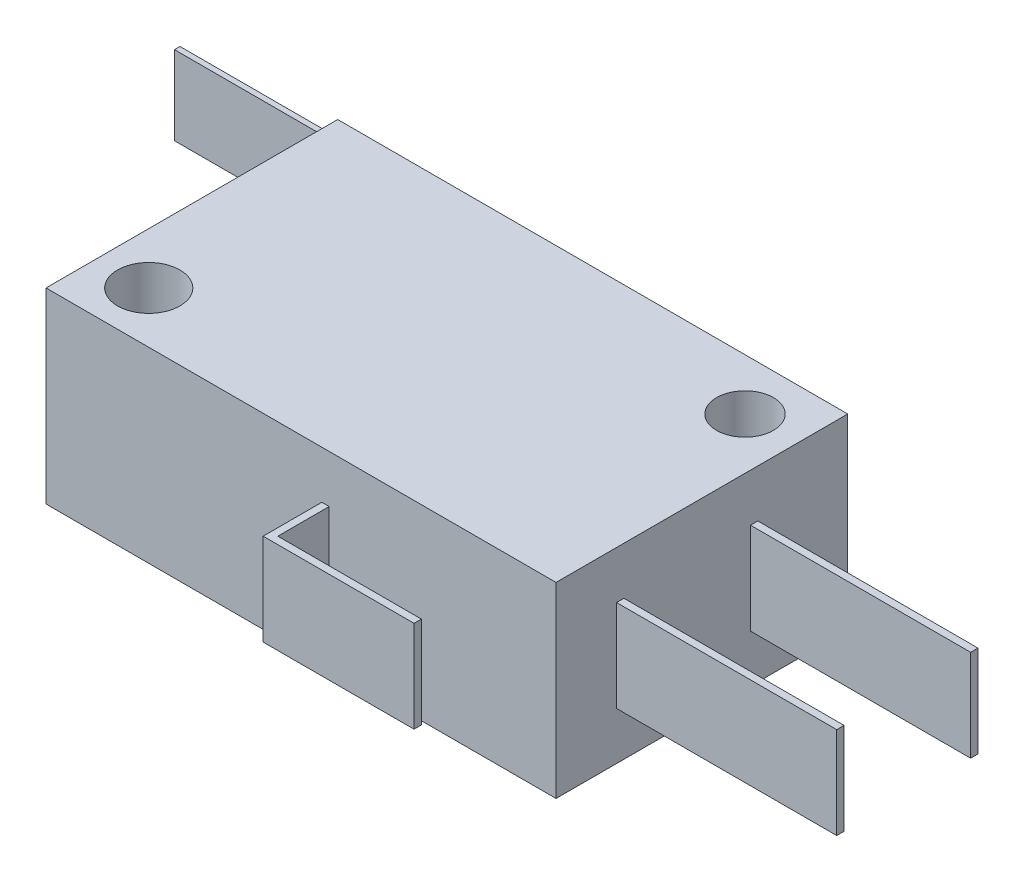
ISO-10303-21;
HEADER;
FILE_DESCRIPTION(('STEP AP214'),'2;1');
FILE_NAME('part.step','',(''),(''),'','','');
FILE_SCHEMA(('AUTOMOTIVE_DESIGN { 1 0 10303 214 1 1 1 1 }'));
ENDSEC;
DATA;
#1=APPLICATION_CONTEXT('core data for automotive mechanical design processes');
#2=APPLICATION_PROTOCOL_DEFINITION('international standard','automotive_design',2000,#1);
#3=PRODUCT_CONTEXT('',#1,'mechanical');
#4=PRODUCT('Part','Part','',(#3));
#5=PRODUCT_RELATED_PRODUCT_CATEGORY('part','',(#4));
#6=PRODUCT_DEFINITION_FORMATION('','',#4);
#7=PRODUCT_DEFINITION_CONTEXT('part definition',#1,'design');
#8=PRODUCT_DEFINITION('design','',#6,#7);
#9=PRODUCT_DEFINITION_SHAPE('','',#8);
#10=(LENGTH_UNIT() NAMED_UNIT(*) SI_UNIT(.MILLI.,.METRE.));
#11=(NAMED_UNIT(*) PLANE_ANGLE_UNIT() SI_UNIT($,.RADIAN.));
#12=(NAMED_UNIT(*) SI_UNIT($,.STERADIAN.) SOLID_ANGLE_UNIT());
#13=UNCERTAINTY_MEASURE_WITH_UNIT(LENGTH_MEASURE(1.E-05),#10,'distance_accuracy_value','');
#14=(GEOMETRIC_REPRESENTATION_CONTEXT(3) GLOBAL_UNCERTAINTY_ASSIGNED_CONTEXT((#13)) GLOBAL_UNIT_ASSIGNED_CONTEXT((#10,
#11,#12)) REPRESENTATION_CONTEXT('',''));
#15=CARTESIAN_POINT('',(0.,0.,0.));
#16=DIRECTION('',(0.,0.,1.));
#17=DIRECTION('',(1.,0.,0.));
#18=AXIS2_PLACEMENT_3D('',#15,#16,#17);
#19=CARTESIAN_POINT('',(-8.89920067803975,2.15,-7.95));
#20=DIRECTION('',(0.,-1.,0.));
#21=DIRECTION('',(0.,0.,-1.));
#22=AXIS2_PLACEMENT_3D('',#19,#20,#21);
#23=CYLINDRICAL_SURFACE('',#22,1.8);
#24=CARTESIAN_POINT('',(-8.89920067803975,2.15,-7.95));
#25=DIRECTION('',(0.,1.,0.));
#26=DIRECTION('',(0.,0.,1.));
#27=AXIS2_PLACEMENT_3D('',#24,#25,#26);
#28=CIRCLE('',#27,1.8);
#29=CARTESIAN_POINT('',(-8.89920067803975,2.15,-6.15));
#30=VERTEX_POINT('',#29);
#31=EDGE_CURVE('E11',#30,#30,#28,.T.);
#32=ORIENTED_EDGE('',*,*,#31,.F.);
#33=EDGE_LOOP('',(#32));
#34=FACE_BOUND('',#33,.T.);
#35=CARTESIAN_POINT('',(-8.89920067803975,-2.15,-7.95));
#36=DIRECTION('',(0.,1.,0.));
#37=DIRECTION('',(0.,0.,1.));
#38=AXIS2_PLACEMENT_3D('',#35,#36,#37);
#39=CIRCLE('',#38,1.8);
#40=CARTESIAN_POINT('',(-8.89920067803975,-2.15,-6.15));
#41=VERTEX_POINT('',#40);
#42=EDGE_CURVE('E45',#41,#41,#39,.T.);
#43=ORIENTED_EDGE('',*,*,#42,.T.);
#44=EDGE_LOOP('',(#43));
#45=FACE_BOUND('',#44,.T.);
#46=ADVANCED_FACE('F42',(#34,#45),#23,.T.);
#47=CARTESIAN_POINT('',(-8.89920067803975,2.15,-7.95));
#48=DIRECTION('',(0.,1.,0.));
#49=DIRECTION('',(0.,0.,1.));
#50=AXIS2_PLACEMENT_3D('',#47,#48,#49);
#51=PLANE('',#50);
#52=ORIENTED_EDGE('',*,*,#31,.T.);
#53=EDGE_LOOP('',(#52));
#54=FACE_BOUND('',#53,.T.);
#55=ADVANCED_FACE('F57',(#54),#51,.T.);
#56=CARTESIAN_POINT('',(-8.89920067803975,-2.15,-7.95));
#57=DIRECTION('',(0.,1.,0.));
#58=DIRECTION('',(0.,0.,1.));
#59=AXIS2_PLACEMENT_3D('',#56,#57,#58);
#60=PLANE('',#59);
#61=ORIENTED_EDGE('',*,*,#42,.F.);
#62=EDGE_LOOP('',(#61));
#63=FACE_BOUND('',#62,.T.);
#64=ADVANCED_FACE('F55',(#63),#60,.F.);
#65=CLOSED_SHELL('',(#46,#55,#64));
#66=MANIFOLD_SOLID_BREP('B2',#65);
#67=CARTESIAN_POINT('',(-13.9,5.1,7.95));
#68=DIRECTION('',(0.,0.,-1.));
#69=DIRECTION('',(-1.,0.,0.));
#70=AXIS2_PLACEMENT_3D('',#67,#68,#69);
#71=PLANE('',#70);
#72=DIRECTION('',(1.,0.,0.));
#73=VECTOR('',#72,1.);
#74=CARTESIAN_POINT('',(-13.9,-5.1,7.95));
#75=LINE('',#74,#73);
#76=CARTESIAN_POINT('',(-13.9,-5.1,7.95));
#77=VERTEX_POINT('',#76);
#78=CARTESIAN_POINT('',(13.9,-5.1,7.95));
#79=VERTEX_POINT('',#78);
#80=EDGE_CURVE('E386',#77,#79,#75,.T.);
#81=ORIENTED_EDGE('',*,*,#80,.T.);
#82=DIRECTION('',(0.,-1.,0.));
#83=VECTOR('',#82,1.);
#84=CARTESIAN_POINT('',(13.9,5.1,7.95));
#85=LINE('',#84,#83);
#86=CARTESIAN_POINT('',(13.9,5.1,7.95));
#87=VERTEX_POINT('',#86);
#88=EDGE_CURVE('E392',#87,#79,#85,.T.);
#89=ORIENTED_EDGE('',*,*,#88,.F.);
#90=DIRECTION('',(1.,0.,0.));
#91=VECTOR('',#90,1.);
#92=CARTESIAN_POINT('',(-13.9,5.1,7.95));
#93=LINE('',#92,#91);
#94=CARTESIAN_POINT('',(-13.9,5.1,7.95));
#95=VERTEX_POINT('',#94);
#96=EDGE_CURVE('E390',#95,#87,#93,.T.);
#97=ORIENTED_EDGE('',*,*,#96,.F.);
#98=DIRECTION('',(0.,-1.,0.));
#99=VECTOR('',#98,1.);
#100=CARTESIAN_POINT('',(-13.9,5.1,7.95));
#101=LINE('',#100,#99);
#102=EDGE_CURVE('E402',#95,#77,#101,.T.);
#103=ORIENTED_EDGE('',*,*,#102,.T.);
#104=EDGE_LOOP('',(#81,#89,#97,#103));
#105=FACE_BOUND('',#104,.T.);
#106=DIRECTION('',(-1.,0.,0.));
#107=VECTOR('',#106,1.);
#108=CARTESIAN_POINT('',(1.135522271517,2.5,7.95));
#109=LINE('',#108,#107);
#110=CARTESIAN_POINT('',(1.535522271517,2.5,7.95));
#111=VERTEX_POINT('',#110);
#112=CARTESIAN_POINT('',(1.135522271517,2.5,7.95));
#113=VERTEX_POINT('',#112);
#114=EDGE_CURVE('E249',#111,#113,#109,.T.);
#115=ORIENTED_EDGE('',*,*,#114,.F.);
#116=DIRECTION('',(0.,-1.,0.));
#117=VECTOR('',#116,1.);
#118=CARTESIAN_POINT('',(1.535522271517,2.5,7.95));
#119=LINE('',#118,#117);
#120=CARTESIAN_POINT('',(1.535522271517,-2.5,7.95));
#121=VERTEX_POINT('',#120);
#122=EDGE_CURVE('E746',#111,#121,#119,.T.);
#123=ORIENTED_EDGE('',*,*,#122,.T.);
#124=DIRECTION('',(-1.,0.,0.));
#125=VECTOR('',#124,1.);
#126=CARTESIAN_POINT('',(1.135522271517,-2.5,7.95));
#127=LINE('',#126,#125);
#128=CARTESIAN_POINT('',(1.135522271517,-2.5,7.95));
#129=VERTEX_POINT('',#128);
#130=EDGE_CURVE('E262',#121,#129,#127,.T.);
#131=ORIENTED_EDGE('',*,*,#130,.T.);
#132=DIRECTION('',(0.,-1.,0.));
#133=VECTOR('',#132,1.);
#134=CARTESIAN_POINT('',(1.135522271517,2.5,7.95));
#135=LINE('',#134,#133);
#136=EDGE_CURVE('E97',#113,#129,#135,.T.);
#137=ORIENTED_EDGE('',*,*,#136,.F.);
#138=EDGE_LOOP('',(#115,#123,#131,#137));
#139=FACE_BOUND('',#138,.T.);
#140=ADVANCED_FACE('F82',(#105,#139),#71,.F.);
#141=CARTESIAN_POINT('',(13.9,5.1,7.95));
#142=DIRECTION('',(-1.,0.,0.));
#143=DIRECTION('',(0.,0.,1.));
#144=AXIS2_PLACEMENT_3D('',#141,#142,#143);
#145=PLANE('',#144);
#146=DIRECTION('',(0.,0.,1.));
#147=VECTOR('',#146,1.);
#148=CARTESIAN_POINT('',(13.9,2.5,-2.65));
#149=LINE('',#148,#147);
#150=CARTESIAN_POINT('',(13.9,2.5,-3.05));
#151=VERTEX_POINT('',#150);
#152=CARTESIAN_POINT('',(13.9,2.5,-2.65));
#153=VERTEX_POINT('',#152);
#154=EDGE_CURVE('E297',#151,#153,#149,.T.);
#155=ORIENTED_EDGE('',*,*,#154,.F.);
#156=DIRECTION('',(0.,-1.,0.));
#157=VECTOR('',#156,1.);
#158=CARTESIAN_POINT('',(13.9,2.5,-3.05));
#159=LINE('',#158,#157);
#160=CARTESIAN_POINT('',(13.9,-2.5,-3.05));
#161=VERTEX_POINT('',#160);
#162=EDGE_CURVE('E307',#151,#161,#159,.T.);
#163=ORIENTED_EDGE('',*,*,#162,.T.);
#164=DIRECTION('',(0.,0.,1.));
#165=VECTOR('',#164,1.);
#166=CARTESIAN_POINT('',(13.9,-2.5,-2.65));
#167=LINE('',#166,#165);
#168=CARTESIAN_POINT('',(13.9,-2.5,-2.65));
#169=VERTEX_POINT('',#168);
#170=EDGE_CURVE('E296',#161,#169,#167,.T.);
#171=ORIENTED_EDGE('',*,*,#170,.T.);
#172=DIRECTION('',(0.,-1.,0.));
#173=VECTOR('',#172,1.);
#174=CARTESIAN_POINT('',(13.9,2.5,-2.65));
#175=LINE('',#174,#173);
#176=EDGE_CURVE('E323',#153,#169,#175,.T.);
#177=ORIENTED_EDGE('',*,*,#176,.F.);
#178=EDGE_LOOP('',(#155,#163,#171,#177));
#179=FACE_BOUND('',#178,.T.);
#180=DIRECTION('',(0.,0.,-1.));
#181=VECTOR('',#180,1.);
#182=CARTESIAN_POINT('',(13.9,-5.1,7.95));
#183=LINE('',#182,#181);
#184=CARTESIAN_POINT('',(13.9,-5.1,-7.95));
#185=VERTEX_POINT('',#184);
#186=EDGE_CURVE('E377',#79,#185,#183,.T.);
#187=ORIENTED_EDGE('',*,*,#186,.T.);
#188=DIRECTION('',(0.,-1.,0.));
#189=VECTOR('',#188,1.);
#190=CARTESIAN_POINT('',(13.9,5.1,-7.95));
#191=LINE('',#190,#189);
#192=CARTESIAN_POINT('',(13.9,5.1,-7.95));
#193=VERTEX_POINT('',#192);
#194=EDGE_CURVE('E40',#193,#185,#191,.T.);
#195=ORIENTED_EDGE('',*,*,#194,.F.);
#196=DIRECTION('',(0.,0.,-1.));
#197=VECTOR('',#196,1.);
#198=CARTESIAN_POINT('',(13.9,5.1,7.95));
#199=LINE('',#198,#197);
#200=EDGE_CURVE('E382',#87,#193,#199,.T.);
#201=ORIENTED_EDGE('',*,*,#200,.F.);
#202=ORIENTED_EDGE('',*,*,#88,.T.);
#203=EDGE_LOOP('',(#187,#195,#201,#202));
#204=FACE_BOUND('',#203,.T.);
#205=DIRECTION('',(0.,0.,1.));
#206=VECTOR('',#205,1.);
#207=CARTESIAN_POINT('',(13.9,2.5,4.65));
#208=LINE('',#207,#206);
#209=CARTESIAN_POINT('',(13.9,2.5,4.25));
#210=VERTEX_POINT('',#209);
#211=CARTESIAN_POINT('',(13.9,2.5,4.65));
#212=VERTEX_POINT('',#211);
#213=EDGE_CURVE('E272',#210,#212,#208,.T.);
#214=ORIENTED_EDGE('',*,*,#213,.F.);
#215=DIRECTION('',(0.,-1.,0.));
#216=VECTOR('',#215,1.);
#217=CARTESIAN_POINT('',(13.9,2.5,4.25));
#218=LINE('',#217,#216);
#219=CARTESIAN_POINT('',(13.9,-2.5,4.25));
#220=VERTEX_POINT('',#219);
#221=EDGE_CURVE('E281',#210,#220,#218,.T.);
#222=ORIENTED_EDGE('',*,*,#221,.T.);
#223=DIRECTION('',(0.,0.,1.));
#224=VECTOR('',#223,1.);
#225=CARTESIAN_POINT('',(13.9,-2.5,4.65));
#226=LINE('',#225,#224);
#227=CARTESIAN_POINT('',(13.9,-2.5,4.65));
#228=VERTEX_POINT('',#227);
#229=EDGE_CURVE('E263',#220,#228,#226,.T.);
#230=ORIENTED_EDGE('',*,*,#229,.T.);
#231=DIRECTION('',(0.,-1.,0.));
#232=VECTOR('',#231,1.);
#233=CARTESIAN_POINT('',(13.9,2.5,4.65));
#234=LINE('',#233,#232);
#235=EDGE_CURVE('E105',#212,#228,#234,.T.);
#236=ORIENTED_EDGE('',*,*,#235,.F.);
#237=EDGE_LOOP('',(#214,#222,#230,#236));
#238=FACE_BOUND('',#237,.T.);
#239=ADVANCED_FACE('F84',(#179,#204,#238),#145,.F.);
#240=CARTESIAN_POINT('',(-13.9,5.1,-7.95));
#241=DIRECTION('',(0.,0.,1.));
#242=DIRECTION('',(1.,0.,0.));
#243=AXIS2_PLACEMENT_3D('',#240,#241,#242);
#244=PLANE('',#243);
#245=DIRECTION('',(0.,-1.,0.));
#246=VECTOR('',#245,1.);
#247=CARTESIAN_POINT('',(2.9,2.15,-7.95));
#248=LINE('',#247,#246);
#249=CARTESIAN_POINT('',(2.9,2.15,-7.95));
#250=VERTEX_POINT('',#249);
#251=CARTESIAN_POINT('',(2.9,-2.15,-7.95));
#252=VERTEX_POINT('',#251);
#253=EDGE_CURVE('E366',#250,#252,#248,.T.);
#254=ORIENTED_EDGE('',*,*,#253,.F.);
#255=DIRECTION('',(1.,0.,0.));
#256=VECTOR('',#255,1.);
#257=CARTESIAN_POINT('',(2.6,2.15,-7.95));
#258=LINE('',#257,#256);
#259=CARTESIAN_POINT('',(2.6,2.15,-7.95));
#260=VERTEX_POINT('',#259);
#261=EDGE_CURVE('E326',#260,#250,#258,.T.);
#262=ORIENTED_EDGE('',*,*,#261,.F.);
#263=DIRECTION('',(0.,-1.,0.));
#264=VECTOR('',#263,1.);
#265=CARTESIAN_POINT('',(2.6,2.15,-7.95));
#266=LINE('',#265,#264);
#267=CARTESIAN_POINT('',(2.6,-2.15,-7.95));
#268=VERTEX_POINT('',#267);
#269=EDGE_CURVE('E341',#260,#268,#266,.T.);
#270=ORIENTED_EDGE('',*,*,#269,.T.);
#271=DIRECTION('',(1.,0.,0.));
#272=VECTOR('',#271,1.);
#273=CARTESIAN_POINT('',(2.6,-2.15,-7.95));
#274=LINE('',#273,#272);
#275=EDGE_CURVE('E325',#268,#252,#274,.T.);
#276=ORIENTED_EDGE('',*,*,#275,.T.);
#277=EDGE_LOOP('',(#254,#262,#270,#276));
#278=FACE_BOUND('',#277,.T.);
#279=DIRECTION('',(-1.,0.,0.));
#280=VECTOR('',#279,1.);
#281=CARTESIAN_POINT('',(-13.9,-5.1,-7.95));
#282=LINE('',#281,#280);
#283=CARTESIAN_POINT('',(-13.9,-5.1,-7.95));
#284=VERTEX_POINT('',#283);
#285=EDGE_CURVE('E395',#185,#284,#282,.T.);
#286=ORIENTED_EDGE('',*,*,#285,.T.);
#287=DIRECTION('',(0.,-1.,0.));
#288=VECTOR('',#287,1.);
#289=CARTESIAN_POINT('',(-13.9,5.1,-7.95));
#290=LINE('',#289,#288);
#291=CARTESIAN_POINT('',(-13.9,5.1,-7.95));
#292=VERTEX_POINT('',#291);
#293=EDGE_CURVE('E90',#292,#284,#290,.T.);
#294=ORIENTED_EDGE('',*,*,#293,.F.);
#295=DIRECTION('',(-1.,0.,0.));
#296=VECTOR('',#295,1.);
#297=CARTESIAN_POINT('',(-13.9,5.1,-7.95));
#298=LINE('',#297,#296);
#299=EDGE_CURVE('E385',#193,#292,#298,.T.);
#300=ORIENTED_EDGE('',*,*,#299,.F.);
#301=ORIENTED_EDGE('',*,*,#194,.T.);
#302=EDGE_LOOP('',(#286,#294,#300,#301));
#303=FACE_BOUND('',#302,.T.);
#304=ADVANCED_FACE('F425',(#278,#303),#244,.F.);
#305=CARTESIAN_POINT('',(-13.9,5.1,7.95));
#306=DIRECTION('',(1.,0.,0.));
#307=DIRECTION('',(0.,0.,-1.));
#308=AXIS2_PLACEMENT_3D('',#305,#306,#307);
#309=PLANE('',#308);
#310=DIRECTION('',(0.,0.,1.));
#311=VECTOR('',#310,1.);
#312=CARTESIAN_POINT('',(-13.9,-5.1,7.95));
#313=LINE('',#312,#311);
#314=EDGE_CURVE('E397',#284,#77,#313,.T.);
#315=ORIENTED_EDGE('',*,*,#314,.T.);
#316=ORIENTED_EDGE('',*,*,#102,.F.);
#317=DIRECTION('',(0.,0.,1.));
#318=VECTOR('',#317,1.);
#319=CARTESIAN_POINT('',(-13.9,5.1,7.95));
#320=LINE('',#319,#318);
#321=EDGE_CURVE('E388',#292,#95,#320,.T.);
#322=ORIENTED_EDGE('',*,*,#321,.F.);
#323=ORIENTED_EDGE('',*,*,#293,.T.);
#324=EDGE_LOOP('',(#315,#316,#322,#323));
#325=FACE_BOUND('',#324,.T.);
#326=ADVANCED_FACE('F409',(#325),#309,.F.);
#327=CARTESIAN_POINT('',(0.,5.1,0.));
#328=DIRECTION('',(0.,-1.,0.));
#329=DIRECTION('',(0.,0.,-1.));
#330=AXIS2_PLACEMENT_3D('',#327,#328,#329);
#331=PLANE('',#330);
#332=CARTESIAN_POINT('',(-11.1,5.1,5.15));
#333=DIRECTION('',(0.,1.,0.));
#334=DIRECTION('',(0.,0.,1.));
#335=AXIS2_PLACEMENT_3D('',#332,#333,#334);
#336=CIRCLE('',#335,1.7);
#337=CARTESIAN_POINT('',(-11.1,5.1,6.85));
#338=VERTEX_POINT('',#337);
#339=EDGE_CURVE('E370',#338,#338,#336,.T.);
#340=ORIENTED_EDGE('',*,*,#339,.F.);
#341=EDGE_LOOP('',(#340));
#342=FACE_BOUND('',#341,.T.);
#343=CARTESIAN_POINT('',(11.1,5.1,-5.15));
#344=DIRECTION('',(0.,1.,0.));
#345=DIRECTION('',(0.,0.,1.));
#346=AXIS2_PLACEMENT_3D('',#343,#344,#345);
#347=CIRCLE('',#346,1.55);
#348=CARTESIAN_POINT('',(11.1,5.1,-3.6));
#349=VERTEX_POINT('',#348);
#350=EDGE_CURVE('E374',#349,#349,#347,.T.);
#351=ORIENTED_EDGE('',*,*,#350,.F.);
#352=EDGE_LOOP('',(#351));
#353=FACE_BOUND('',#352,.T.);
#354=ORIENTED_EDGE('',*,*,#200,.T.);
#355=ORIENTED_EDGE('',*,*,#299,.T.);
#356=ORIENTED_EDGE('',*,*,#321,.T.);
#357=ORIENTED_EDGE('',*,*,#96,.T.);
#358=EDGE_LOOP('',(#354,#355,#356,#357));
#359=FACE_BOUND('',#358,.T.);
#360=ADVANCED_FACE('F424',(#342,#353,#359),#331,.F.);
#361=CARTESIAN_POINT('',(0.,-5.1,0.));
#362=DIRECTION('',(0.,-1.,0.));
#363=DIRECTION('',(0.,0.,-1.));
#364=AXIS2_PLACEMENT_3D('',#361,#362,#363);
#365=PLANE('',#364);
#366=CARTESIAN_POINT('',(-11.1,-5.1,5.15));
#367=DIRECTION('',(0.,1.,0.));
#368=DIRECTION('',(0.,0.,1.));
#369=AXIS2_PLACEMENT_3D('',#366,#367,#368);
#370=CIRCLE('',#369,1.7);
#371=CARTESIAN_POINT('',(-11.1,-5.1,6.85));
#372=VERTEX_POINT('',#371);
#373=EDGE_CURVE('E373',#372,#372,#370,.T.);
#374=ORIENTED_EDGE('',*,*,#373,.T.);
#375=EDGE_LOOP('',(#374));
#376=FACE_BOUND('',#375,.T.);
#377=CARTESIAN_POINT('',(11.1,-5.1,-5.15));
#378=DIRECTION('',(0.,1.,0.));
#379=DIRECTION('',(0.,0.,1.));
#380=AXIS2_PLACEMENT_3D('',#377,#378,#379);
#381=CIRCLE('',#380,1.55);
#382=CARTESIAN_POINT('',(11.1,-5.1,-3.6));
#383=VERTEX_POINT('',#382);
#384=EDGE_CURVE('E369',#383,#383,#381,.T.);
#385=ORIENTED_EDGE('',*,*,#384,.T.);
#386=EDGE_LOOP('',(#385));
#387=FACE_BOUND('',#386,.T.);
#388=ORIENTED_EDGE('',*,*,#186,.F.);
#389=ORIENTED_EDGE('',*,*,#80,.F.);
#390=ORIENTED_EDGE('',*,*,#314,.F.);
#391=ORIENTED_EDGE('',*,*,#285,.F.);
#392=EDGE_LOOP('',(#388,#389,#390,#391));
#393=FACE_BOUND('',#392,.T.);
#394=ADVANCED_FACE('F415',(#376,#387,#393),#365,.T.);
#395=CARTESIAN_POINT('',(11.1,-5.1,-5.15));
#396=DIRECTION('',(0.,1.,0.));
#397=DIRECTION('',(0.,0.,1.));
#398=AXIS2_PLACEMENT_3D('',#395,#396,#397);
#399=CYLINDRICAL_SURFACE('',#398,1.55);
#400=ORIENTED_EDGE('',*,*,#384,.F.);
#401=EDGE_LOOP('',(#400));
#402=FACE_BOUND('',#401,.T.);
#403=ORIENTED_EDGE('',*,*,#350,.T.);
#404=EDGE_LOOP('',(#403));
#405=FACE_BOUND('',#404,.T.);
#406=ADVANCED_FACE('F441',(#402,#405),#399,.F.);
#407=CARTESIAN_POINT('',(-11.1,-5.1,5.15));
#408=DIRECTION('',(0.,1.,0.));
#409=DIRECTION('',(0.,0.,1.));
#410=AXIS2_PLACEMENT_3D('',#407,#408,#409);
#411=CYLINDRICAL_SURFACE('',#410,1.7);
#412=ORIENTED_EDGE('',*,*,#373,.F.);
#413=EDGE_LOOP('',(#412));
#414=FACE_BOUND('',#413,.T.);
#415=ORIENTED_EDGE('',*,*,#339,.T.);
#416=EDGE_LOOP('',(#415));
#417=FACE_BOUND('',#416,.T.);
#418=ADVANCED_FACE('F448',(#414,#417),#411,.F.);
#419=CARTESIAN_POINT('',(2.9,2.15,-7.95));
#420=DIRECTION('',(-1.,0.,0.));
#421=DIRECTION('',(0.,0.,1.));
#422=AXIS2_PLACEMENT_3D('',#419,#420,#421);
#423=PLANE('',#422);
#424=DIRECTION('',(0.,0.,-1.));
#425=VECTOR('',#424,1.);
#426=CARTESIAN_POINT('',(2.9,-2.15,-7.95));
#427=LINE('',#426,#425);
#428=CARTESIAN_POINT('',(2.9,-2.15,-10.05));
#429=VERTEX_POINT('',#428);
#430=EDGE_CURVE('E343',#252,#429,#427,.T.);
#431=ORIENTED_EDGE('',*,*,#430,.T.);
#432=DIRECTION('',(0.,-1.,0.));
#433=VECTOR('',#432,1.);
#434=CARTESIAN_POINT('',(2.9,2.15,-10.05));
#435=LINE('',#434,#433);
#436=CARTESIAN_POINT('',(2.9,2.15,-10.05));
#437=VERTEX_POINT('',#436);
#438=EDGE_CURVE('E363',#437,#429,#435,.T.);
#439=ORIENTED_EDGE('',*,*,#438,.F.);
#440=DIRECTION('',(0.,0.,-1.));
#441=VECTOR('',#440,1.);
#442=CARTESIAN_POINT('',(2.9,2.15,-7.95));
#443=LINE('',#442,#441);
#444=EDGE_CURVE('E329',#250,#437,#443,.T.);
#445=ORIENTED_EDGE('',*,*,#444,.F.);
#446=ORIENTED_EDGE('',*,*,#253,.T.);
#447=EDGE_LOOP('',(#431,#439,#445,#446));
#448=FACE_BOUND('',#447,.T.);
#449=ADVANCED_FACE('F452',(#448),#423,.F.);
#450=CARTESIAN_POINT('',(2.9,2.15,-10.05));
#451=DIRECTION('',(0.,0.,1.));
#452=DIRECTION('',(1.,0.,0.));
#453=AXIS2_PLACEMENT_3D('',#450,#451,#452);
#454=PLANE('',#453);
#455=DIRECTION('',(-1.,0.,0.));
#456=VECTOR('',#455,1.);
#457=CARTESIAN_POINT('',(2.9,-2.15,-10.05));
#458=LINE('',#457,#456);
#459=CARTESIAN_POINT('',(-24.6,-2.15,-10.05));
#460=VERTEX_POINT('',#459);
#461=EDGE_CURVE('E345',#429,#460,#458,.T.);
#462=ORIENTED_EDGE('',*,*,#461,.T.);
#463=DIRECTION('',(0.,-1.,0.));
#464=VECTOR('',#463,1.);
#465=CARTESIAN_POINT('',(-24.6,2.15,-10.05));
#466=LINE('',#465,#464);
#467=CARTESIAN_POINT('',(-24.6,2.15,-10.05));
#468=VERTEX_POINT('',#467);
#469=EDGE_CURVE('E360',#468,#460,#466,.T.);
#470=ORIENTED_EDGE('',*,*,#469,.F.);
#471=DIRECTION('',(-1.,0.,0.));
#472=VECTOR('',#471,1.);
#473=CARTESIAN_POINT('',(2.9,2.15,-10.05));
#474=LINE('',#473,#472);
#475=EDGE_CURVE('E332',#437,#468,#474,.T.);
#476=ORIENTED_EDGE('',*,*,#475,.F.);
#477=ORIENTED_EDGE('',*,*,#438,.T.);
#478=EDGE_LOOP('',(#462,#470,#476,#477));
#479=FACE_BOUND('',#478,.T.);
#480=ADVANCED_FACE('F456',(#479),#454,.F.);
#481=CARTESIAN_POINT('',(-24.6,2.15,-10.05));
#482=DIRECTION('',(1.,0.,0.));
#483=DIRECTION('',(0.,0.,-1.));
#484=AXIS2_PLACEMENT_3D('',#481,#482,#483);
#485=PLANE('',#484);
#486=DIRECTION('',(0.,0.,1.));
#487=VECTOR('',#486,1.);
#488=CARTESIAN_POINT('',(-24.6,-2.15,-10.05));
#489=LINE('',#488,#487);
#490=CARTESIAN_POINT('',(-24.6,-2.15,-9.75));
#491=VERTEX_POINT('',#490);
#492=EDGE_CURVE('E347',#460,#491,#489,.T.);
#493=ORIENTED_EDGE('',*,*,#492,.T.);
#494=DIRECTION('',(0.,-1.,0.));
#495=VECTOR('',#494,1.);
#496=CARTESIAN_POINT('',(-24.6,2.15,-9.75));
#497=LINE('',#496,#495);
#498=CARTESIAN_POINT('',(-24.6,2.15,-9.75));
#499=VERTEX_POINT('',#498);
#500=EDGE_CURVE('E357',#499,#491,#497,.T.);
#501=ORIENTED_EDGE('',*,*,#500,.F.);
#502=DIRECTION('',(0.,0.,1.));
#503=VECTOR('',#502,1.);
#504=CARTESIAN_POINT('',(-24.6,2.15,-10.05));
#505=LINE('',#504,#503);
#506=EDGE_CURVE('E334',#468,#499,#505,.T.);
#507=ORIENTED_EDGE('',*,*,#506,.F.);
#508=ORIENTED_EDGE('',*,*,#469,.T.);
#509=EDGE_LOOP('',(#493,#501,#507,#508));
#510=FACE_BOUND('',#509,.T.);
#511=ADVANCED_FACE('F460',(#510),#485,.F.);
#512=CARTESIAN_POINT('',(-24.6,2.15,-9.75));
#513=DIRECTION('',(0.,0.,-1.));
#514=DIRECTION('',(-1.,0.,0.));
#515=AXIS2_PLACEMENT_3D('',#512,#513,#514);
#516=PLANE('',#515);
#517=DIRECTION('',(1.,0.,0.));
#518=VECTOR('',#517,1.);
#519=CARTESIAN_POINT('',(-24.6,-2.15,-9.75));
#520=LINE('',#519,#518);
#521=CARTESIAN_POINT('',(2.6,-2.15,-9.75));
#522=VERTEX_POINT('',#521);
#523=EDGE_CURVE('E349',#491,#522,#520,.T.);
#524=ORIENTED_EDGE('',*,*,#523,.T.);
#525=DIRECTION('',(0.,-1.,0.));
#526=VECTOR('',#525,1.);
#527=CARTESIAN_POINT('',(2.6,2.15,-9.75));
#528=LINE('',#527,#526);
#529=CARTESIAN_POINT('',(2.6,2.15,-9.75));
#530=VERTEX_POINT('',#529);
#531=EDGE_CURVE('E354',#530,#522,#528,.T.);
#532=ORIENTED_EDGE('',*,*,#531,.F.);
#533=DIRECTION('',(1.,0.,0.));
#534=VECTOR('',#533,1.);
#535=CARTESIAN_POINT('',(-24.6,2.15,-9.75));
#536=LINE('',#535,#534);
#537=EDGE_CURVE('E336',#499,#530,#536,.T.);
#538=ORIENTED_EDGE('',*,*,#537,.F.);
#539=ORIENTED_EDGE('',*,*,#500,.T.);
#540=EDGE_LOOP('',(#524,#532,#538,#539));
#541=FACE_BOUND('',#540,.T.);
#542=ADVANCED_FACE('F464',(#541),#516,.F.);
#543=CARTESIAN_POINT('',(2.6,2.15,-9.75));
#544=DIRECTION('',(1.,0.,0.));
#545=DIRECTION('',(0.,0.,-1.));
#546=AXIS2_PLACEMENT_3D('',#543,#544,#545);
#547=PLANE('',#546);
#548=DIRECTION('',(0.,0.,1.));
#549=VECTOR('',#548,1.);
#550=CARTESIAN_POINT('',(2.6,-2.15,-9.75));
#551=LINE('',#550,#549);
#552=EDGE_CURVE('E330',#522,#268,#551,.T.);
#553=ORIENTED_EDGE('',*,*,#552,.T.);
#554=ORIENTED_EDGE('',*,*,#269,.F.);
#555=DIRECTION('',(0.,0.,1.));
#556=VECTOR('',#555,1.);
#557=CARTESIAN_POINT('',(2.6,2.15,-9.75));
#558=LINE('',#557,#556);
#559=EDGE_CURVE('E338',#530,#260,#558,.T.);
#560=ORIENTED_EDGE('',*,*,#559,.F.);
#561=ORIENTED_EDGE('',*,*,#531,.T.);
#562=EDGE_LOOP('',(#553,#554,#560,#561));
#563=FACE_BOUND('',#562,.T.);
#564=ADVANCED_FACE('F468',(#563),#547,.F.);
#565=CARTESIAN_POINT('',(0.,2.15,0.));
#566=DIRECTION('',(0.,1.,0.));
#567=DIRECTION('',(0.,0.,1.));
#568=AXIS2_PLACEMENT_3D('',#565,#566,#567);
#569=PLANE('',#568);
#570=ORIENTED_EDGE('',*,*,#261,.T.);
#571=ORIENTED_EDGE('',*,*,#444,.T.);
#572=ORIENTED_EDGE('',*,*,#475,.T.);
#573=ORIENTED_EDGE('',*,*,#506,.T.);
#574=ORIENTED_EDGE('',*,*,#537,.T.);
#575=ORIENTED_EDGE('',*,*,#559,.T.);
#576=EDGE_LOOP('',(#570,#571,#572,#573,#574,#575));
#577=FACE_BOUND('',#576,.T.);
#578=ADVANCED_FACE('F472',(#577),#569,.T.);
#579=CARTESIAN_POINT('',(0.,-2.15,0.));
#580=DIRECTION('',(0.,1.,0.));
#581=DIRECTION('',(0.,0.,1.));
#582=AXIS2_PLACEMENT_3D('',#579,#580,#581);
#583=PLANE('',#582);
#584=ORIENTED_EDGE('',*,*,#275,.F.);
#585=ORIENTED_EDGE('',*,*,#552,.F.);
#586=ORIENTED_EDGE('',*,*,#523,.F.);
#587=ORIENTED_EDGE('',*,*,#492,.F.);
#588=ORIENTED_EDGE('',*,*,#461,.F.);
#589=ORIENTED_EDGE('',*,*,#430,.F.);
#590=EDGE_LOOP('',(#584,#585,#586,#587,#588,#589));
#591=FACE_BOUND('',#590,.T.);
#592=ADVANCED_FACE('F474',(#591),#583,.F.);
#593=CARTESIAN_POINT('',(25.9,2.5,-2.65));
#594=DIRECTION('',(0.,0.,-1.));
#595=DIRECTION('',(-1.,0.,0.));
#596=AXIS2_PLACEMENT_3D('',#593,#594,#595);
#597=PLANE('',#596);
#598=DIRECTION('',(1.,0.,0.));
#599=VECTOR('',#598,1.);
#600=CARTESIAN_POINT('',(25.9,-2.5,-2.65));
#601=LINE('',#600,#599);
#602=CARTESIAN_POINT('',(25.9,-2.5,-2.65));
#603=VERTEX_POINT('',#602);
#604=EDGE_CURVE('E310',#169,#603,#601,.T.);
#605=ORIENTED_EDGE('',*,*,#604,.T.);
#606=DIRECTION('',(0.,-1.,0.));
#607=VECTOR('',#606,1.);
#608=CARTESIAN_POINT('',(25.9,2.5,-2.65));
#609=LINE('',#608,#607);
#610=CARTESIAN_POINT('',(25.9,2.5,-2.65));
#611=VERTEX_POINT('',#610);
#612=EDGE_CURVE('E320',#611,#603,#609,.T.);
#613=ORIENTED_EDGE('',*,*,#612,.F.);
#614=DIRECTION('',(1.,0.,0.));
#615=VECTOR('',#614,1.);
#616=CARTESIAN_POINT('',(25.9,2.5,-2.65));
#617=LINE('',#616,#615);
#618=EDGE_CURVE('E300',#153,#611,#617,.T.);
#619=ORIENTED_EDGE('',*,*,#618,.F.);
#620=ORIENTED_EDGE('',*,*,#176,.T.);
#621=EDGE_LOOP('',(#605,#613,#619,#620));
#622=FACE_BOUND('',#621,.T.);
#623=ADVANCED_FACE('F477',(#622),#597,.F.);
#624=CARTESIAN_POINT('',(25.9,2.5,-3.05));
#625=DIRECTION('',(-1.,0.,0.));
#626=DIRECTION('',(0.,0.,1.));
#627=AXIS2_PLACEMENT_3D('',#624,#625,#626);
#628=PLANE('',#627);
#629=DIRECTION('',(0.,0.,-1.));
#630=VECTOR('',#629,1.);
#631=CARTESIAN_POINT('',(25.9,-2.5,-3.05));
#632=LINE('',#631,#630);
#633=CARTESIAN_POINT('',(25.9,-2.5,-3.05));
#634=VERTEX_POINT('',#633);
#635=EDGE_CURVE('E312',#603,#634,#632,.T.);
#636=ORIENTED_EDGE('',*,*,#635,.T.);
#637=DIRECTION('',(0.,-1.,0.));
#638=VECTOR('',#637,1.);
#639=CARTESIAN_POINT('',(25.9,2.5,-3.05));
#640=LINE('',#639,#638);
#641=CARTESIAN_POINT('',(25.9,2.5,-3.05));
#642=VERTEX_POINT('',#641);
#643=EDGE_CURVE('E317',#642,#634,#640,.T.);
#644=ORIENTED_EDGE('',*,*,#643,.F.);
#645=DIRECTION('',(0.,0.,-1.));
#646=VECTOR('',#645,1.);
#647=CARTESIAN_POINT('',(25.9,2.5,-3.05));
#648=LINE('',#647,#646);
#649=EDGE_CURVE('E303',#611,#642,#648,.T.);
#650=ORIENTED_EDGE('',*,*,#649,.F.);
#651=ORIENTED_EDGE('',*,*,#612,.T.);
#652=EDGE_LOOP('',(#636,#644,#650,#651));
#653=FACE_BOUND('',#652,.T.);
#654=ADVANCED_FACE('F484',(#653),#628,.F.);
#655=CARTESIAN_POINT('',(13.9,2.5,-3.05));
#656=DIRECTION('',(0.,0.,1.));
#657=DIRECTION('',(1.,0.,0.));
#658=AXIS2_PLACEMENT_3D('',#655,#656,#657);
#659=PLANE('',#658);
#660=DIRECTION('',(-1.,0.,0.));
#661=VECTOR('',#660,1.);
#662=CARTESIAN_POINT('',(13.9,-2.5,-3.05));
#663=LINE('',#662,#661);
#664=EDGE_CURVE('E301',#634,#161,#663,.T.);
#665=ORIENTED_EDGE('',*,*,#664,.T.);
#666=ORIENTED_EDGE('',*,*,#162,.F.);
#667=DIRECTION('',(-1.,0.,0.));
#668=VECTOR('',#667,1.);
#669=CARTESIAN_POINT('',(13.9,2.5,-3.05));
#670=LINE('',#669,#668);
#671=EDGE_CURVE('E305',#642,#151,#670,.T.);
#672=ORIENTED_EDGE('',*,*,#671,.F.);
#673=ORIENTED_EDGE('',*,*,#643,.T.);
#674=EDGE_LOOP('',(#665,#666,#672,#673));
#675=FACE_BOUND('',#674,.T.);
#676=ADVANCED_FACE('F488',(#675),#659,.F.);
#677=CARTESIAN_POINT('',(0.,2.5,0.));
#678=DIRECTION('',(0.,-1.,0.));
#679=DIRECTION('',(0.,0.,-1.));
#680=AXIS2_PLACEMENT_3D('',#677,#678,#679);
#681=PLANE('',#680);
#682=ORIENTED_EDGE('',*,*,#154,.T.);
#683=ORIENTED_EDGE('',*,*,#618,.T.);
#684=ORIENTED_EDGE('',*,*,#649,.T.);
#685=ORIENTED_EDGE('',*,*,#671,.T.);
#686=EDGE_LOOP('',(#682,#683,#684,#685));
#687=FACE_BOUND('',#686,.T.);
#688=ADVANCED_FACE('F492',(#687),#681,.F.);
#689=CARTESIAN_POINT('',(0.,-2.5,0.));
#690=DIRECTION('',(0.,-1.,0.));
#691=DIRECTION('',(0.,0.,-1.));
#692=AXIS2_PLACEMENT_3D('',#689,#690,#691);
#693=PLANE('',#692);
#694=ORIENTED_EDGE('',*,*,#170,.F.);
#695=ORIENTED_EDGE('',*,*,#664,.F.);
#696=ORIENTED_EDGE('',*,*,#635,.F.);
#697=ORIENTED_EDGE('',*,*,#604,.F.);
#698=EDGE_LOOP('',(#694,#695,#696,#697));
#699=FACE_BOUND('',#698,.T.);
#700=ADVANCED_FACE('F494',(#699),#693,.T.);
#701=CARTESIAN_POINT('',(25.9,2.5,4.65));
#702=DIRECTION('',(0.,0.,-1.));
#703=DIRECTION('',(-1.,0.,0.));
#704=AXIS2_PLACEMENT_3D('',#701,#702,#703);
#705=PLANE('',#704);
#706=DIRECTION('',(1.,0.,0.));
#707=VECTOR('',#706,1.);
#708=CARTESIAN_POINT('',(25.9,-2.5,4.65));
#709=LINE('',#708,#707);
#710=CARTESIAN_POINT('',(25.9,-2.5,4.65));
#711=VERTEX_POINT('',#710);
#712=EDGE_CURVE('E266',#228,#711,#709,.T.);
#713=ORIENTED_EDGE('',*,*,#712,.T.);
#714=DIRECTION('',(0.,-1.,0.));
#715=VECTOR('',#714,1.);
#716=CARTESIAN_POINT('',(25.9,2.5,4.65));
#717=LINE('',#716,#715);
#718=CARTESIAN_POINT('',(25.9,2.5,4.65));
#719=VERTEX_POINT('',#718);
#720=EDGE_CURVE('E292',#719,#711,#717,.T.);
#721=ORIENTED_EDGE('',*,*,#720,.F.);
#722=DIRECTION('',(1.,0.,0.));
#723=VECTOR('',#722,1.);
#724=CARTESIAN_POINT('',(25.9,2.5,4.65));
#725=LINE('',#724,#723);
#726=EDGE_CURVE('E275',#212,#719,#725,.T.);
#727=ORIENTED_EDGE('',*,*,#726,.F.);
#728=ORIENTED_EDGE('',*,*,#235,.T.);
#729=EDGE_LOOP('',(#713,#721,#727,#728));
#730=FACE_BOUND('',#729,.T.);
#731=ADVANCED_FACE('F497',(#730),#705,.F.);
#732=CARTESIAN_POINT('',(25.9,2.5,4.25));
#733=DIRECTION('',(-1.,0.,0.));
#734=DIRECTION('',(0.,0.,1.));
#735=AXIS2_PLACEMENT_3D('',#732,#733,#734);
#736=PLANE('',#735);
#737=DIRECTION('',(0.,0.,-1.));
#738=VECTOR('',#737,1.);
#739=CARTESIAN_POINT('',(25.9,-2.5,4.25));
#740=LINE('',#739,#738);
#741=CARTESIAN_POINT('',(25.9,-2.5,4.25));
#742=VERTEX_POINT('',#741);
#743=EDGE_CURVE('E284',#711,#742,#740,.T.);
#744=ORIENTED_EDGE('',*,*,#743,.T.);
#745=DIRECTION('',(0.,-1.,0.));
#746=VECTOR('',#745,1.);
#747=CARTESIAN_POINT('',(25.9,2.5,4.25));
#748=LINE('',#747,#746);
#749=CARTESIAN_POINT('',(25.9,2.5,4.25));
#750=VERTEX_POINT('',#749);
#751=EDGE_CURVE('E289',#750,#742,#748,.T.);
#752=ORIENTED_EDGE('',*,*,#751,.F.);
#753=DIRECTION('',(0.,0.,-1.));
#754=VECTOR('',#753,1.);
#755=CARTESIAN_POINT('',(25.9,2.5,4.25));
#756=LINE('',#755,#754);
#757=EDGE_CURVE('E278',#719,#750,#756,.T.);
#758=ORIENTED_EDGE('',*,*,#757,.F.);
#759=ORIENTED_EDGE('',*,*,#720,.T.);
#760=EDGE_LOOP('',(#744,#752,#758,#759));
#761=FACE_BOUND('',#760,.T.);
#762=ADVANCED_FACE('F504',(#761),#736,.F.);
#763=CARTESIAN_POINT('',(13.9,2.5,4.25));
#764=DIRECTION('',(0.,0.,1.));
#765=DIRECTION('',(1.,0.,0.));
#766=AXIS2_PLACEMENT_3D('',#763,#764,#765);
#767=PLANE('',#766);
#768=DIRECTION('',(-1.,0.,0.));
#769=VECTOR('',#768,1.);
#770=CARTESIAN_POINT('',(13.9,-2.5,4.25));
#771=LINE('',#770,#769);
#772=EDGE_CURVE('E276',#742,#220,#771,.T.);
#773=ORIENTED_EDGE('',*,*,#772,.T.);
#774=ORIENTED_EDGE('',*,*,#221,.F.);
#775=DIRECTION('',(-1.,0.,0.));
#776=VECTOR('',#775,1.);
#777=CARTESIAN_POINT('',(13.9,2.5,4.25));
#778=LINE('',#777,#776);
#779=EDGE_CURVE('E280',#750,#210,#778,.T.);
#780=ORIENTED_EDGE('',*,*,#779,.F.);
#781=ORIENTED_EDGE('',*,*,#751,.T.);
#782=EDGE_LOOP('',(#773,#774,#780,#781));
#783=FACE_BOUND('',#782,.T.);
#784=ADVANCED_FACE('F507',(#783),#767,.F.);
#785=CARTESIAN_POINT('',(0.,2.5,7.3));
#786=DIRECTION('',(0.,-1.,0.));
#787=DIRECTION('',(0.,0.,-1.));
#788=AXIS2_PLACEMENT_3D('',#785,#786,#787);
#789=PLANE('',#788);
#790=ORIENTED_EDGE('',*,*,#213,.T.);
#791=ORIENTED_EDGE('',*,*,#726,.T.);
#792=ORIENTED_EDGE('',*,*,#757,.T.);
#793=ORIENTED_EDGE('',*,*,#779,.T.);
#794=EDGE_LOOP('',(#790,#791,#792,#793));
#795=FACE_BOUND('',#794,.T.);
#796=ADVANCED_FACE('F511',(#795),#789,.F.);
#797=CARTESIAN_POINT('',(0.,-2.5,7.3));
#798=DIRECTION('',(0.,-1.,0.));
#799=DIRECTION('',(0.,0.,-1.));
#800=AXIS2_PLACEMENT_3D('',#797,#798,#799);
#801=PLANE('',#800);
#802=ORIENTED_EDGE('',*,*,#229,.F.);
#803=ORIENTED_EDGE('',*,*,#772,.F.);
#804=ORIENTED_EDGE('',*,*,#743,.F.);
#805=ORIENTED_EDGE('',*,*,#712,.F.);
#806=EDGE_LOOP('',(#802,#803,#804,#805));
#807=FACE_BOUND('',#806,.T.);
#808=ADVANCED_FACE('F513',(#807),#801,.T.);
#809=CARTESIAN_POINT('',(1.135522271517,2.5,11.15));
#810=DIRECTION('',(1.,0.,0.));
#811=DIRECTION('',(0.,0.,-1.));
#812=AXIS2_PLACEMENT_3D('',#809,#810,#811);
#813=PLANE('',#812);
#814=DIRECTION('',(0.,0.,1.));
#815=VECTOR('',#814,1.);
#816=CARTESIAN_POINT('',(1.135522271517,-2.5,11.15));
#817=LINE('',#816,#815);
#818=CARTESIAN_POINT('',(1.135522271517,-2.5,11.15));
#819=VERTEX_POINT('',#818);
#820=EDGE_CURVE('E744',#129,#819,#817,.T.);
#821=ORIENTED_EDGE('',*,*,#820,.T.);
#822=DIRECTION('',(0.,-1.,0.));
#823=VECTOR('',#822,1.);
#824=CARTESIAN_POINT('',(1.135522271517,2.5,11.15));
#825=LINE('',#824,#823);
#826=CARTESIAN_POINT('',(1.135522271517,2.5,11.15));
#827=VERTEX_POINT('',#826);
#828=EDGE_CURVE('E245',#827,#819,#825,.T.);
#829=ORIENTED_EDGE('',*,*,#828,.F.);
#830=DIRECTION('',(0.,0.,1.));
#831=VECTOR('',#830,1.);
#832=CARTESIAN_POINT('',(1.135522271517,2.5,11.15));
#833=LINE('',#832,#831);
#834=EDGE_CURVE('E241',#113,#827,#833,.T.);
#835=ORIENTED_EDGE('',*,*,#834,.F.);
#836=ORIENTED_EDGE('',*,*,#136,.T.);
#837=EDGE_LOOP('',(#821,#829,#835,#836));
#838=FACE_BOUND('',#837,.T.);
#839=ADVANCED_FACE('F243',(#838),#813,.F.);
#840=CARTESIAN_POINT('',(9.36104352129002,2.5,11.15));
#841=DIRECTION('',(0.,0.,-1.));
#842=DIRECTION('',(-1.,0.,0.));
#843=AXIS2_PLACEMENT_3D('',#840,#841,#842);
#844=PLANE('',#843);
#845=DIRECTION('',(1.,0.,0.));
#846=VECTOR('',#845,1.);
#847=CARTESIAN_POINT('',(9.36104352129002,-2.5,11.15));
#848=LINE('',#847,#846);
#849=CARTESIAN_POINT('',(9.36104352129002,-2.5,11.15));
#850=VERTEX_POINT('',#849);
#851=EDGE_CURVE('E765',#819,#850,#848,.T.);
#852=ORIENTED_EDGE('',*,*,#851,.T.);
#853=DIRECTION('',(0.,-1.,0.));
#854=VECTOR('',#853,1.);
#855=CARTESIAN_POINT('',(9.36104352129002,2.5,11.15));
#856=LINE('',#855,#854);
#857=CARTESIAN_POINT('',(9.36104352129002,2.5,11.15));
#858=VERTEX_POINT('',#857);
#859=EDGE_CURVE('E268',#858,#850,#856,.T.);
#860=ORIENTED_EDGE('',*,*,#859,.F.);
#861=DIRECTION('',(1.,0.,0.));
#862=VECTOR('',#861,1.);
#863=CARTESIAN_POINT('',(9.36104352129002,2.5,11.15));
#864=LINE('',#863,#862);
#865=EDGE_CURVE('E248',#827,#858,#864,.T.);
#866=ORIENTED_EDGE('',*,*,#865,.F.);
#867=ORIENTED_EDGE('',*,*,#828,.T.);
#868=EDGE_LOOP('',(#852,#860,#866,#867));
#869=FACE_BOUND('',#868,.T.);
#870=ADVANCED_FACE('F522',(#869),#844,.F.);
#871=CARTESIAN_POINT('',(9.36104352129002,2.5,10.75));
#872=DIRECTION('',(-1.,0.,0.));
#873=DIRECTION('',(0.,0.,1.));
#874=AXIS2_PLACEMENT_3D('',#871,#872,#873);
#875=PLANE('',#874);
#876=DIRECTION('',(0.,0.,-1.));
#877=VECTOR('',#876,1.);
#878=CARTESIAN_POINT('',(9.36104352129002,-2.5,10.75));
#879=LINE('',#878,#877);
#880=CARTESIAN_POINT('',(9.36104352129002,-2.5,10.75));
#881=VERTEX_POINT('',#880);
#882=EDGE_CURVE('E763',#850,#881,#879,.T.);
#883=ORIENTED_EDGE('',*,*,#882,.T.);
#884=DIRECTION('',(0.,-1.,0.));
#885=VECTOR('',#884,1.);
#886=CARTESIAN_POINT('',(9.36104352129002,2.5,10.75));
#887=LINE('',#886,#885);
#888=CARTESIAN_POINT('',(9.36104352129002,2.5,10.75));
#889=VERTEX_POINT('',#888);
#890=EDGE_CURVE('E750',#889,#881,#887,.T.);
#891=ORIENTED_EDGE('',*,*,#890,.F.);
#892=DIRECTION('',(0.,0.,-1.));
#893=VECTOR('',#892,1.);
#894=CARTESIAN_POINT('',(9.36104352129002,2.5,10.75));
#895=LINE('',#894,#893);
#896=EDGE_CURVE('E764',#858,#889,#895,.T.);
#897=ORIENTED_EDGE('',*,*,#896,.F.);
#898=ORIENTED_EDGE('',*,*,#859,.T.);
#899=EDGE_LOOP('',(#883,#891,#897,#898));
#900=FACE_BOUND('',#899,.T.);
#901=ADVANCED_FACE('F525',(#900),#875,.F.);
#902=CARTESIAN_POINT('',(1.535522271517,2.5,10.75));
#903=DIRECTION('',(0.,0.,1.));
#904=DIRECTION('',(1.,0.,0.));
#905=AXIS2_PLACEMENT_3D('',#902,#903,#904);
#906=PLANE('',#905);
#907=DIRECTION('',(-1.,0.,0.));
#908=VECTOR('',#907,1.);
#909=CARTESIAN_POINT('',(1.535522271517,-2.5,10.75));
#910=LINE('',#909,#908);
#911=CARTESIAN_POINT('',(1.535522271517,-2.5,10.75));
#912=VERTEX_POINT('',#911);
#913=EDGE_CURVE('E766',#881,#912,#910,.T.);
#914=ORIENTED_EDGE('',*,*,#913,.T.);
#915=DIRECTION('',(0.,-1.,0.));
#916=VECTOR('',#915,1.);
#917=CARTESIAN_POINT('',(1.535522271517,2.5,10.75));
#918=LINE('',#917,#916);
#919=CARTESIAN_POINT('',(1.535522271517,2.5,10.75));
#920=VERTEX_POINT('',#919);
#921=EDGE_CURVE('E747',#920,#912,#918,.T.);
#922=ORIENTED_EDGE('',*,*,#921,.F.);
#923=DIRECTION('',(-1.,0.,0.));
#924=VECTOR('',#923,1.);
#925=CARTESIAN_POINT('',(1.535522271517,2.5,10.75));
#926=LINE('',#925,#924);
#927=EDGE_CURVE('E752',#889,#920,#926,.T.);
#928=ORIENTED_EDGE('',*,*,#927,.F.);
#929=ORIENTED_EDGE('',*,*,#890,.T.);
#930=EDGE_LOOP('',(#914,#922,#928,#929));
#931=FACE_BOUND('',#930,.T.);
#932=ADVANCED_FACE('F529',(#931),#906,.F.);
#933=CARTESIAN_POINT('',(1.535522271517,2.5,7.95));
#934=DIRECTION('',(-1.,0.,0.));
#935=DIRECTION('',(0.,0.,1.));
#936=AXIS2_PLACEMENT_3D('',#933,#934,#935);
#937=PLANE('',#936);
#938=DIRECTION('',(0.,0.,-1.));
#939=VECTOR('',#938,1.);
#940=CARTESIAN_POINT('',(1.535522271517,-2.5,7.95));
#941=LINE('',#940,#939);
#942=EDGE_CURVE('E258',#912,#121,#941,.T.);
#943=ORIENTED_EDGE('',*,*,#942,.T.);
#944=ORIENTED_EDGE('',*,*,#122,.F.);
#945=DIRECTION('',(0.,0.,-1.));
#946=VECTOR('',#945,1.);
#947=CARTESIAN_POINT('',(1.535522271517,2.5,7.95));
#948=LINE('',#947,#946);
#949=EDGE_CURVE('E254',#920,#111,#948,.T.);
#950=ORIENTED_EDGE('',*,*,#949,.F.);
#951=ORIENTED_EDGE('',*,*,#921,.T.);
#952=EDGE_LOOP('',(#943,#944,#950,#951));
#953=FACE_BOUND('',#952,.T.);
#954=ADVANCED_FACE('F533',(#953),#937,.F.);
#955=CARTESIAN_POINT('',(0.,2.5,0.));
#956=DIRECTION('',(0.,-1.,0.));
#957=DIRECTION('',(0.,0.,-1.));
#958=AXIS2_PLACEMENT_3D('',#955,#956,#957);
#959=PLANE('',#958);
#960=ORIENTED_EDGE('',*,*,#114,.T.);
#961=ORIENTED_EDGE('',*,*,#834,.T.);
#962=ORIENTED_EDGE('',*,*,#865,.T.);
#963=ORIENTED_EDGE('',*,*,#896,.T.);
#964=ORIENTED_EDGE('',*,*,#927,.T.);
#965=ORIENTED_EDGE('',*,*,#949,.T.);
#966=EDGE_LOOP('',(#960,#961,#962,#963,#964,#965));
#967=FACE_BOUND('',#966,.T.);
#968=ADVANCED_FACE('F252',(#967),#959,.F.);
#969=CARTESIAN_POINT('',(0.,-2.5,0.));
#970=DIRECTION('',(0.,-1.,0.));
#971=DIRECTION('',(0.,0.,-1.));
#972=AXIS2_PLACEMENT_3D('',#969,#970,#971);
#973=PLANE('',#972);
#974=ORIENTED_EDGE('',*,*,#130,.F.);
#975=ORIENTED_EDGE('',*,*,#942,.F.);
#976=ORIENTED_EDGE('',*,*,#913,.F.);
#977=ORIENTED_EDGE('',*,*,#882,.F.);
#978=ORIENTED_EDGE('',*,*,#851,.F.);
#979=ORIENTED_EDGE('',*,*,#820,.F.);
#980=EDGE_LOOP('',(#974,#975,#976,#977,#978,#979));
#981=FACE_BOUND('',#980,.T.);
#982=ADVANCED_FACE('F538',(#981),#973,.T.);
#983=CLOSED_SHELL('',(#140,#239,#304,#326,#360,#394,#406,#418,#449,#480,#511,#542,#564,#578,
#592,#623,#654,#676,#688,#700,#731,#762,#784,#796,#808,#839,#870,#901,#932,#954,#968,#982));
#984=MANIFOLD_SOLID_BREP('B6',#983);
#985=ADVANCED_BREP_SHAPE_REPRESENTATION('',(#18,#66,#984),#14);
#986=SHAPE_DEFINITION_REPRESENTATION(#9,#985);
ENDSEC;
END-ISO-10303-21;
